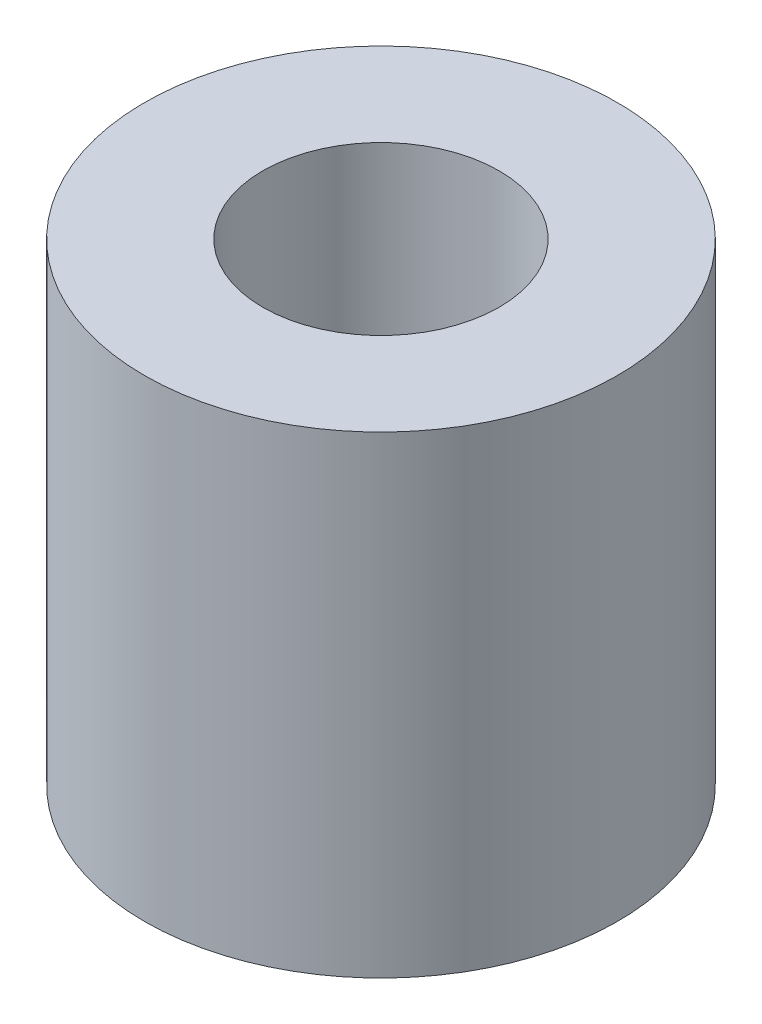
ISO-10303-21;
HEADER;
FILE_DESCRIPTION(('STEP AP214'),'2;1');
FILE_NAME('part.step','',(''),(''),'','','');
FILE_SCHEMA(('AUTOMOTIVE_DESIGN { 1 0 10303 214 1 1 1 1 }'));
ENDSEC;
DATA;
#1=APPLICATION_CONTEXT('core data for automotive mechanical design processes');
#2=APPLICATION_PROTOCOL_DEFINITION('international standard','automotive_design',2000,#1);
#3=PRODUCT_CONTEXT('',#1,'mechanical');
#4=PRODUCT('Part','Part','',(#3));
#5=PRODUCT_RELATED_PRODUCT_CATEGORY('part','',(#4));
#6=PRODUCT_DEFINITION_FORMATION('','',#4);
#7=PRODUCT_DEFINITION_CONTEXT('part definition',#1,'design');
#8=PRODUCT_DEFINITION('design','',#6,#7);
#9=PRODUCT_DEFINITION_SHAPE('','',#8);
#10=(LENGTH_UNIT() NAMED_UNIT(*) SI_UNIT(.MILLI.,.METRE.));
#11=(NAMED_UNIT(*) PLANE_ANGLE_UNIT() SI_UNIT($,.RADIAN.));
#12=(NAMED_UNIT(*) SI_UNIT($,.STERADIAN.) SOLID_ANGLE_UNIT());
#13=UNCERTAINTY_MEASURE_WITH_UNIT(LENGTH_MEASURE(1.E-05),#10,'distance_accuracy_value','');
#14=(GEOMETRIC_REPRESENTATION_CONTEXT(3) GLOBAL_UNCERTAINTY_ASSIGNED_CONTEXT((#13)) GLOBAL_UNIT_ASSIGNED_CONTEXT((#10,
#11,#12)) REPRESENTATION_CONTEXT('',''));
#15=CARTESIAN_POINT('',(0.,0.,0.));
#16=DIRECTION('',(0.,0.,1.));
#17=DIRECTION('',(1.,0.,0.));
#18=AXIS2_PLACEMENT_3D('',#15,#16,#17);
#19=CARTESIAN_POINT('',(0.,10.,0.));
#20=DIRECTION('',(0.,1.,0.));
#21=DIRECTION('',(0.,0.,1.));
#22=AXIS2_PLACEMENT_3D('',#19,#20,#21);
#23=PLANE('',#22);
#24=CARTESIAN_POINT('',(0.,10.,0.));
#25=DIRECTION('',(0.,1.,0.));
#26=DIRECTION('',(0.,0.,1.));
#27=AXIS2_PLACEMENT_3D('',#24,#25,#26);
#28=CIRCLE('',#27,3.);
#29=CARTESIAN_POINT('',(0.,10.,3.));
#30=VERTEX_POINT('',#29);
#31=EDGE_CURVE('E38',#30,#30,#28,.T.);
#32=ORIENTED_EDGE('',*,*,#31,.F.);
#33=EDGE_LOOP('',(#32));
#34=FACE_BOUND('',#33,.T.);
#35=CARTESIAN_POINT('',(0.,10.,0.));
#36=DIRECTION('',(0.,1.,0.));
#37=DIRECTION('',(0.,0.,1.));
#38=AXIS2_PLACEMENT_3D('',#35,#36,#37);
#39=CIRCLE('',#38,5.);
#40=CARTESIAN_POINT('',(0.,10.,5.));
#41=VERTEX_POINT('',#40);
#42=EDGE_CURVE('E52',#41,#41,#39,.T.);
#43=ORIENTED_EDGE('',*,*,#42,.T.);
#44=EDGE_LOOP('',(#43));
#45=FACE_BOUND('',#44,.T.);
#46=ADVANCED_FACE('F31',(#34,#45),#23,.T.);
#47=CARTESIAN_POINT('',(0.,0.,0.));
#48=DIRECTION('',(0.,1.,0.));
#49=DIRECTION('',(0.,0.,1.));
#50=AXIS2_PLACEMENT_3D('',#47,#48,#49);
#51=PLANE('',#50);
#52=CARTESIAN_POINT('',(0.,0.,0.));
#53=DIRECTION('',(0.,1.,0.));
#54=DIRECTION('',(0.,0.,1.));
#55=AXIS2_PLACEMENT_3D('',#52,#53,#54);
#56=CIRCLE('',#55,10.);
#57=CARTESIAN_POINT('',(0.,0.,10.));
#58=VERTEX_POINT('',#57);
#59=EDGE_CURVE('E10',#58,#58,#56,.T.);
#60=ORIENTED_EDGE('',*,*,#59,.F.);
#61=EDGE_LOOP('',(#60));
#62=FACE_BOUND('',#61,.T.);
#63=CARTESIAN_POINT('',(0.,0.,0.));
#64=DIRECTION('',(0.,1.,0.));
#65=DIRECTION('',(0.,0.,1.));
#66=AXIS2_PLACEMENT_3D('',#63,#64,#65);
#67=CIRCLE('',#66,3.);
#68=CARTESIAN_POINT('',(0.,0.,3.));
#69=VERTEX_POINT('',#68);
#70=EDGE_CURVE('E42',#69,#69,#67,.T.);
#71=ORIENTED_EDGE('',*,*,#70,.T.);
#72=EDGE_LOOP('',(#71));
#73=FACE_BOUND('',#72,.T.);
#74=ADVANCED_FACE('F73',(#62,#73),#51,.F.);
#75=CARTESIAN_POINT('',(0.,10.,0.));
#76=DIRECTION('',(0.,-1.,0.));
#77=DIRECTION('',(0.,0.,-1.));
#78=AXIS2_PLACEMENT_3D('',#75,#76,#77);
#79=CYLINDRICAL_SURFACE('',#78,10.);
#80=ORIENTED_EDGE('',*,*,#59,.T.);
#81=EDGE_LOOP('',(#80));
#82=FACE_BOUND('',#81,.T.);
#83=CARTESIAN_POINT('',(0.,20.,0.));
#84=DIRECTION('',(0.,1.,0.));
#85=DIRECTION('',(0.,0.,1.));
#86=AXIS2_PLACEMENT_3D('',#83,#84,#85);
#87=CIRCLE('',#86,10.);
#88=CARTESIAN_POINT('',(0.,20.,10.));
#89=VERTEX_POINT('',#88);
#90=EDGE_CURVE('E47',#89,#89,#87,.T.);
#91=ORIENTED_EDGE('',*,*,#90,.F.);
#92=EDGE_LOOP('',(#91));
#93=FACE_BOUND('',#92,.T.);
#94=ADVANCED_FACE('F33',(#82,#93),#79,.T.);
#95=CARTESIAN_POINT('',(0.,10.,0.));
#96=DIRECTION('',(0.,-1.,0.));
#97=DIRECTION('',(0.,0.,-1.));
#98=AXIS2_PLACEMENT_3D('',#95,#96,#97);
#99=CYLINDRICAL_SURFACE('',#98,3.);
#100=ORIENTED_EDGE('',*,*,#31,.T.);
#101=EDGE_LOOP('',(#100));
#102=FACE_BOUND('',#101,.T.);
#103=ORIENTED_EDGE('',*,*,#70,.F.);
#104=EDGE_LOOP('',(#103));
#105=FACE_BOUND('',#104,.T.);
#106=ADVANCED_FACE('F63',(#102,#105),#99,.F.);
#107=CARTESIAN_POINT('',(0.,20.,0.));
#108=DIRECTION('',(0.,1.,0.));
#109=DIRECTION('',(0.,0.,1.));
#110=AXIS2_PLACEMENT_3D('',#107,#108,#109);
#111=PLANE('',#110);
#112=ORIENTED_EDGE('',*,*,#90,.T.);
#113=EDGE_LOOP('',(#112));
#114=FACE_BOUND('',#113,.T.);
#115=CARTESIAN_POINT('',(0.,20.,0.));
#116=DIRECTION('',(0.,1.,0.));
#117=DIRECTION('',(0.,0.,1.));
#118=AXIS2_PLACEMENT_3D('',#115,#116,#117);
#119=CIRCLE('',#118,5.);
#120=CARTESIAN_POINT('',(0.,20.,5.));
#121=VERTEX_POINT('',#120);
#122=EDGE_CURVE('E51',#121,#121,#119,.T.);
#123=ORIENTED_EDGE('',*,*,#122,.F.);
#124=EDGE_LOOP('',(#123));
#125=FACE_BOUND('',#124,.T.);
#126=ADVANCED_FACE('F61',(#114,#125),#111,.T.);
#127=CARTESIAN_POINT('',(0.,20.,0.));
#128=DIRECTION('',(0.,-1.,0.));
#129=DIRECTION('',(0.,0.,-1.));
#130=AXIS2_PLACEMENT_3D('',#127,#128,#129);
#131=CYLINDRICAL_SURFACE('',#130,5.);
#132=ORIENTED_EDGE('',*,*,#122,.T.);
#133=EDGE_LOOP('',(#132));
#134=FACE_BOUND('',#133,.T.);
#135=ORIENTED_EDGE('',*,*,#42,.F.);
#136=EDGE_LOOP('',(#135));
#137=FACE_BOUND('',#136,.T.);
#138=ADVANCED_FACE('F58',(#134,#137),#131,.F.);
#139=CLOSED_SHELL('',(#46,#74,#94,#106,#126,#138));
#140=MANIFOLD_SOLID_BREP('B2',#139);
#141=ADVANCED_BREP_SHAPE_REPRESENTATION('',(#18,#140),#14);
#142=SHAPE_DEFINITION_REPRESENTATION(#9,#141);
ENDSEC;
END-ISO-10303-21;
